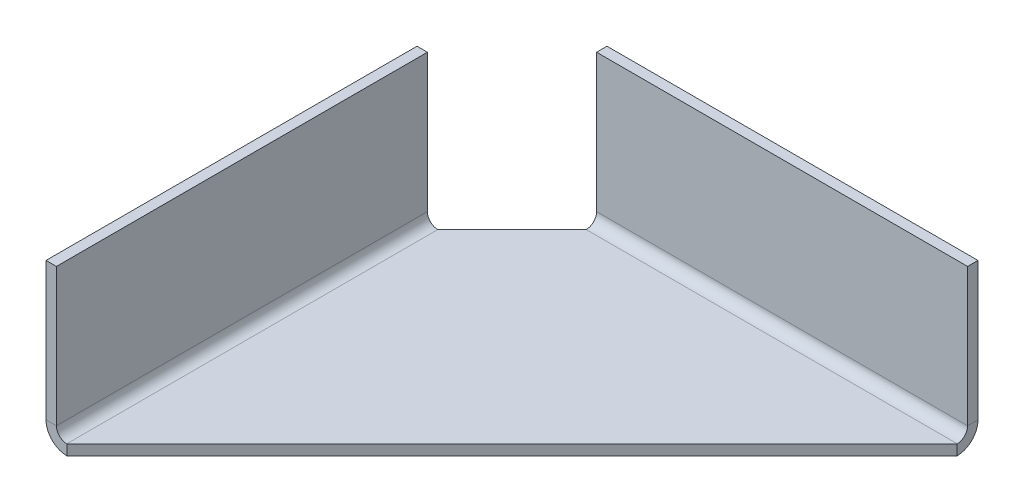
ISO-10303-21;
HEADER;
FILE_DESCRIPTION(('STEP AP214'),'2;1');
FILE_NAME('part.step','',(''),(''),'','','');
FILE_SCHEMA(('AUTOMOTIVE_DESIGN { 1 0 10303 214 1 1 1 1 }'));
ENDSEC;
DATA;
#1=APPLICATION_CONTEXT('core data for automotive mechanical design processes');
#2=APPLICATION_PROTOCOL_DEFINITION('international standard','automotive_design',2000,#1);
#3=PRODUCT_CONTEXT('',#1,'mechanical');
#4=PRODUCT('Part','Part','',(#3));
#5=PRODUCT_RELATED_PRODUCT_CATEGORY('part','',(#4));
#6=PRODUCT_DEFINITION_FORMATION('','',#4);
#7=PRODUCT_DEFINITION_CONTEXT('part definition',#1,'design');
#8=PRODUCT_DEFINITION('design','',#6,#7);
#9=PRODUCT_DEFINITION_SHAPE('','',#8);
#10=(LENGTH_UNIT() NAMED_UNIT(*) SI_UNIT(.MILLI.,.METRE.));
#11=(NAMED_UNIT(*) PLANE_ANGLE_UNIT() SI_UNIT($,.RADIAN.));
#12=(NAMED_UNIT(*) SI_UNIT($,.STERADIAN.) SOLID_ANGLE_UNIT());
#13=UNCERTAINTY_MEASURE_WITH_UNIT(LENGTH_MEASURE(1.E-05),#10,'distance_accuracy_value','');
#14=(GEOMETRIC_REPRESENTATION_CONTEXT(3) GLOBAL_UNCERTAINTY_ASSIGNED_CONTEXT((#13)) GLOBAL_UNIT_ASSIGNED_CONTEXT((#10,
#11,#12)) REPRESENTATION_CONTEXT('',''));
#15=CARTESIAN_POINT('',(0.,0.,0.));
#16=DIRECTION('',(0.,0.,1.));
#17=DIRECTION('',(1.,0.,0.));
#18=AXIS2_PLACEMENT_3D('',#15,#16,#17);
#19=CARTESIAN_POINT('',(30.,-0.7,0.));
#20=DIRECTION('',(0.707106781186548,0.,0.707106781186547));
#21=DIRECTION('',(0.707106781186547,0.,-0.707106781186548));
#22=AXIS2_PLACEMENT_3D('',#19,#20,#21);
#23=PLANE('',#22);
#24=DIRECTION('',(0.707106781186547,0.,-0.707106781186548));
#25=VECTOR('',#24,1.);
#26=CARTESIAN_POINT('',(30.,0.,0.));
#27=LINE('',#26,#25);
#28=CARTESIAN_POINT('',(0.,0.,30.));
#29=VERTEX_POINT('',#28);
#30=CARTESIAN_POINT('',(30.,0.,0.));
#31=VERTEX_POINT('',#30);
#32=EDGE_CURVE('E267',#29,#31,#27,.T.);
#33=ORIENTED_EDGE('',*,*,#32,.F.);
#34=DIRECTION('',(0.,1.,0.));
#35=VECTOR('',#34,1.);
#36=CARTESIAN_POINT('',(0.,-0.7,30.));
#37=LINE('',#36,#35);
#38=CARTESIAN_POINT('',(0.,-0.699999999999998,30.));
#39=VERTEX_POINT('',#38);
#40=EDGE_CURVE('E272',#39,#29,#37,.T.);
#41=ORIENTED_EDGE('',*,*,#40,.F.);
#42=DIRECTION('',(0.707106781186547,0.,-0.707106781186548));
#43=VECTOR('',#42,1.);
#44=CARTESIAN_POINT('',(30.,-0.7,0.));
#45=LINE('',#44,#43);
#46=CARTESIAN_POINT('',(30.,-0.7,0.));
#47=VERTEX_POINT('',#46);
#48=EDGE_CURVE('E269',#39,#47,#45,.T.);
#49=ORIENTED_EDGE('',*,*,#48,.T.);
#50=DIRECTION('',(0.,1.,0.));
#51=VECTOR('',#50,1.);
#52=CARTESIAN_POINT('',(30.,-0.7,0.));
#53=LINE('',#52,#51);
#54=EDGE_CURVE('E278',#47,#31,#53,.T.);
#55=ORIENTED_EDGE('',*,*,#54,.T.);
#56=EDGE_LOOP('',(#33,#41,#49,#55));
#57=FACE_BOUND('',#56,.T.);
#58=ADVANCED_FACE('F78',(#57),#23,.T.);
#59=CARTESIAN_POINT('',(0.,-0.7,0.));
#60=DIRECTION('',(0.,-1.,0.));
#61=DIRECTION('',(0.,0.,-1.));
#62=AXIS2_PLACEMENT_3D('',#59,#60,#61);
#63=PLANE('',#62);
#64=DIRECTION('',(0.,0.,1.));
#65=VECTOR('',#64,1.);
#66=CARTESIAN_POINT('',(0.,-0.7,0.));
#67=LINE('',#66,#65);
#68=CARTESIAN_POINT('',(0.,-0.7,5.));
#69=VERTEX_POINT('',#68);
#70=EDGE_CURVE('E92',#69,#39,#67,.T.);
#71=ORIENTED_EDGE('',*,*,#70,.F.);
#72=DIRECTION('',(-0.707106781186547,0.,0.707106781186548));
#73=VECTOR('',#72,1.);
#74=CARTESIAN_POINT('',(2.5,-0.7,2.5));
#75=LINE('',#74,#73);
#76=CARTESIAN_POINT('',(5.,-0.700000000000008,0.));
#77=VERTEX_POINT('',#76);
#78=EDGE_CURVE('E13',#69,#77,#75,.F.);
#79=ORIENTED_EDGE('',*,*,#78,.T.);
#80=DIRECTION('',(-1.,0.,0.));
#81=VECTOR('',#80,1.);
#82=CARTESIAN_POINT('',(0.,-0.7,0.));
#83=LINE('',#82,#81);
#84=EDGE_CURVE('E174',#47,#77,#83,.T.);
#85=ORIENTED_EDGE('',*,*,#84,.F.);
#86=ORIENTED_EDGE('',*,*,#48,.F.);
#87=EDGE_LOOP('',(#71,#79,#85,#86));
#88=FACE_BOUND('',#87,.T.);
#89=ADVANCED_FACE('F328',(#88),#63,.T.);
#90=CARTESIAN_POINT('',(0.,0.,0.));
#91=DIRECTION('',(0.,-1.,0.));
#92=DIRECTION('',(0.,0.,-1.));
#93=AXIS2_PLACEMENT_3D('',#90,#91,#92);
#94=PLANE('',#93);
#95=DIRECTION('',(-1.,0.,0.));
#96=VECTOR('',#95,1.);
#97=CARTESIAN_POINT('',(0.,0.,0.));
#98=LINE('',#97,#96);
#99=CARTESIAN_POINT('',(5.,0.,0.));
#100=VERTEX_POINT('',#99);
#101=EDGE_CURVE('E257',#31,#100,#98,.T.);
#102=ORIENTED_EDGE('',*,*,#101,.T.);
#103=DIRECTION('',(0.707106781186547,0.,-0.707106781186548));
#104=VECTOR('',#103,1.);
#105=CARTESIAN_POINT('',(5.,0.,0.));
#106=LINE('',#105,#104);
#107=CARTESIAN_POINT('',(0.,0.,5.));
#108=VERTEX_POINT('',#107);
#109=EDGE_CURVE('E100',#100,#108,#106,.F.);
#110=ORIENTED_EDGE('',*,*,#109,.T.);
#111=DIRECTION('',(0.,0.,1.));
#112=VECTOR('',#111,1.);
#113=CARTESIAN_POINT('',(0.,0.,0.));
#114=LINE('',#113,#112);
#115=EDGE_CURVE('E274',#108,#29,#114,.T.);
#116=ORIENTED_EDGE('',*,*,#115,.T.);
#117=ORIENTED_EDGE('',*,*,#32,.T.);
#118=EDGE_LOOP('',(#102,#110,#116,#117));
#119=FACE_BOUND('',#118,.T.);
#120=ADVANCED_FACE('F333',(#119),#94,.F.);
#121=CARTESIAN_POINT('',(5.,-0.7,0.));
#122=DIRECTION('',(0.707106781186548,0.,0.707106781186547));
#123=DIRECTION('',(0.,1.,0.));
#124=AXIS2_PLACEMENT_3D('',#121,#122,#123);
#125=PLANE('',#124);
#126=ORIENTED_EDGE('',*,*,#78,.F.);
#127=DIRECTION('',(0.,-1.,0.));
#128=VECTOR('',#127,1.);
#129=CARTESIAN_POINT('',(0.,-0.7,5.));
#130=LINE('',#129,#128);
#131=EDGE_CURVE('E86',#108,#69,#130,.T.);
#132=ORIENTED_EDGE('',*,*,#131,.F.);
#133=ORIENTED_EDGE('',*,*,#109,.F.);
#134=DIRECTION('',(0.,1.,0.));
#135=VECTOR('',#134,1.);
#136=CARTESIAN_POINT('',(5.,-0.7,0.));
#137=LINE('',#136,#135);
#138=EDGE_CURVE('E280',#77,#100,#137,.T.);
#139=ORIENTED_EDGE('',*,*,#138,.F.);
#140=EDGE_LOOP('',(#126,#132,#133,#139));
#141=FACE_BOUND('',#140,.T.);
#142=ADVANCED_FACE('F80',(#141),#125,.F.);
#143=CARTESIAN_POINT('',(0.,0.699999999999999,5.));
#144=DIRECTION('',(0.,0.,-1.));
#145=DIRECTION('',(-1.,0.,0.));
#146=AXIS2_PLACEMENT_3D('',#143,#144,#145);
#147=PLANE('',#146);
#148=DIRECTION('',(1.,0.,0.));
#149=VECTOR('',#148,1.);
#150=CARTESIAN_POINT('',(-1.4,0.699999999999995,5.));
#151=LINE('',#150,#149);
#152=CARTESIAN_POINT('',(-0.699999999999999,0.699999999999997,5.));
#153=VERTEX_POINT('',#152);
#154=CARTESIAN_POINT('',(-1.4,0.699999999999994,5.));
#155=VERTEX_POINT('',#154);
#156=EDGE_CURVE('E219',#153,#155,#151,.F.);
#157=ORIENTED_EDGE('',*,*,#156,.F.);
#158=CARTESIAN_POINT('',(0.,0.699999999999999,5.));
#159=DIRECTION('',(0.,0.,1.));
#160=DIRECTION('',(1.,0.,0.));
#161=AXIS2_PLACEMENT_3D('',#158,#159,#160);
#162=CIRCLE('',#161,0.7);
#163=EDGE_CURVE('E261',#108,#153,#162,.F.);
#164=ORIENTED_EDGE('',*,*,#163,.F.);
#165=ORIENTED_EDGE('',*,*,#131,.T.);
#166=CARTESIAN_POINT('',(0.,0.699999999999999,5.));
#167=DIRECTION('',(0.,0.,1.));
#168=DIRECTION('',(1.,0.,0.));
#169=AXIS2_PLACEMENT_3D('',#166,#167,#168);
#170=CIRCLE('',#169,1.4);
#171=EDGE_CURVE('E254',#69,#155,#170,.F.);
#172=ORIENTED_EDGE('',*,*,#171,.T.);
#173=EDGE_LOOP('',(#157,#164,#165,#172));
#174=FACE_BOUND('',#173,.T.);
#175=ADVANCED_FACE('F288',(#174),#147,.T.);
#176=CARTESIAN_POINT('',(0.,0.700000000000001,30.));
#177=DIRECTION('',(0.,0.,-1.));
#178=DIRECTION('',(-1.,0.,0.));
#179=AXIS2_PLACEMENT_3D('',#176,#177,#178);
#180=PLANE('',#179);
#181=CARTESIAN_POINT('',(0.,0.700000000000001,30.));
#182=DIRECTION('',(0.,0.,1.));
#183=DIRECTION('',(1.,0.,0.));
#184=AXIS2_PLACEMENT_3D('',#181,#182,#183);
#185=CIRCLE('',#184,0.7);
#186=CARTESIAN_POINT('',(-0.699999999999995,0.699999999999999,30.));
#187=VERTEX_POINT('',#186);
#188=EDGE_CURVE('E227',#187,#29,#185,.T.);
#189=ORIENTED_EDGE('',*,*,#188,.F.);
#190=DIRECTION('',(1.,0.,0.));
#191=VECTOR('',#190,1.);
#192=CARTESIAN_POINT('',(-0.699999999999996,0.699999999999998,30.));
#193=LINE('',#192,#191);
#194=CARTESIAN_POINT('',(-1.4,0.699999999999996,30.));
#195=VERTEX_POINT('',#194);
#196=EDGE_CURVE('E247',#187,#195,#193,.F.);
#197=ORIENTED_EDGE('',*,*,#196,.T.);
#198=CARTESIAN_POINT('',(0.,0.700000000000001,30.));
#199=DIRECTION('',(0.,0.,1.));
#200=DIRECTION('',(1.,0.,0.));
#201=AXIS2_PLACEMENT_3D('',#198,#199,#200);
#202=CIRCLE('',#201,1.4);
#203=EDGE_CURVE('E258',#195,#39,#202,.T.);
#204=ORIENTED_EDGE('',*,*,#203,.T.);
#205=ORIENTED_EDGE('',*,*,#40,.T.);
#206=EDGE_LOOP('',(#189,#197,#204,#205));
#207=FACE_BOUND('',#206,.T.);
#208=ADVANCED_FACE('F339',(#207),#180,.F.);
#209=CARTESIAN_POINT('',(0.,0.700000000000001,30.));
#210=DIRECTION('',(0.,0.,1.));
#211=DIRECTION('',(-1.,0.,0.));
#212=AXIS2_PLACEMENT_3D('',#209,#210,#211);
#213=CYLINDRICAL_SURFACE('',#212,1.4);
#214=ORIENTED_EDGE('',*,*,#70,.T.);
#215=ORIENTED_EDGE('',*,*,#203,.F.);
#216=DIRECTION('',(0.,0.,1.));
#217=VECTOR('',#216,1.);
#218=CARTESIAN_POINT('',(-1.4,0.699999999999995,5.));
#219=LINE('',#218,#217);
#220=EDGE_CURVE('E245',#195,#155,#219,.F.);
#221=ORIENTED_EDGE('',*,*,#220,.T.);
#222=ORIENTED_EDGE('',*,*,#171,.F.);
#223=EDGE_LOOP('',(#214,#215,#221,#222));
#224=FACE_BOUND('',#223,.T.);
#225=ADVANCED_FACE('F292',(#224),#213,.T.);
#226=CARTESIAN_POINT('',(0.,0.700000000000001,30.));
#227=DIRECTION('',(0.,0.,1.));
#228=DIRECTION('',(-1.,0.,0.));
#229=AXIS2_PLACEMENT_3D('',#226,#227,#228);
#230=CYLINDRICAL_SURFACE('',#229,0.7);
#231=ORIENTED_EDGE('',*,*,#115,.F.);
#232=ORIENTED_EDGE('',*,*,#163,.T.);
#233=DIRECTION('',(0.,0.,1.));
#234=VECTOR('',#233,1.);
#235=CARTESIAN_POINT('',(-0.699999999999999,0.699999999999998,5.));
#236=LINE('',#235,#234);
#237=EDGE_CURVE('E250',#153,#187,#236,.T.);
#238=ORIENTED_EDGE('',*,*,#237,.T.);
#239=ORIENTED_EDGE('',*,*,#188,.T.);
#240=EDGE_LOOP('',(#231,#232,#238,#239));
#241=FACE_BOUND('',#240,.T.);
#242=ADVANCED_FACE('F313',(#241),#230,.F.);
#243=CARTESIAN_POINT('',(-1.40000000000003,10.,30.));
#244=DIRECTION('',(0.,0.,-1.));
#245=DIRECTION('',(-1.,0.,0.));
#246=AXIS2_PLACEMENT_3D('',#243,#244,#245);
#247=PLANE('',#246);
#248=ORIENTED_EDGE('',*,*,#196,.F.);
#249=DIRECTION('',(0.,-1.,0.));
#250=VECTOR('',#249,1.);
#251=CARTESIAN_POINT('',(-0.700000000000029,10.,30.));
#252=LINE('',#251,#250);
#253=CARTESIAN_POINT('',(-0.700000000000029,10.,30.));
#254=VERTEX_POINT('',#253);
#255=EDGE_CURVE('E243',#187,#254,#252,.F.);
#256=ORIENTED_EDGE('',*,*,#255,.T.);
#257=DIRECTION('',(1.,0.,0.));
#258=VECTOR('',#257,1.);
#259=CARTESIAN_POINT('',(-1.40000000000003,10.,30.));
#260=LINE('',#259,#258);
#261=CARTESIAN_POINT('',(-1.40000000000003,10.,30.));
#262=VERTEX_POINT('',#261);
#263=EDGE_CURVE('E224',#262,#254,#260,.T.);
#264=ORIENTED_EDGE('',*,*,#263,.F.);
#265=DIRECTION('',(0.,1.,0.));
#266=VECTOR('',#265,1.);
#267=CARTESIAN_POINT('',(-1.39999999999999,0.,30.));
#268=LINE('',#267,#266);
#269=EDGE_CURVE('E236',#195,#262,#268,.T.);
#270=ORIENTED_EDGE('',*,*,#269,.F.);
#271=EDGE_LOOP('',(#248,#256,#264,#270));
#272=FACE_BOUND('',#271,.T.);
#273=ADVANCED_FACE('F301',(#272),#247,.F.);
#274=CARTESIAN_POINT('',(-1.4,0.,5.));
#275=DIRECTION('',(0.,0.,1.));
#276=DIRECTION('',(1.,0.,0.));
#277=AXIS2_PLACEMENT_3D('',#274,#275,#276);
#278=PLANE('',#277);
#279=ORIENTED_EDGE('',*,*,#156,.T.);
#280=DIRECTION('',(0.,-1.,0.));
#281=VECTOR('',#280,1.);
#282=CARTESIAN_POINT('',(-1.4,0.,5.));
#283=LINE('',#282,#281);
#284=CARTESIAN_POINT('',(-1.40000000000003,10.,5.));
#285=VERTEX_POINT('',#284);
#286=EDGE_CURVE('E231',#285,#155,#283,.T.);
#287=ORIENTED_EDGE('',*,*,#286,.F.);
#288=DIRECTION('',(1.,0.,0.));
#289=VECTOR('',#288,1.);
#290=CARTESIAN_POINT('',(-1.40000000000003,10.,5.));
#291=LINE('',#290,#289);
#292=CARTESIAN_POINT('',(-0.700000000000032,10.,5.));
#293=VERTEX_POINT('',#292);
#294=EDGE_CURVE('E228',#285,#293,#291,.T.);
#295=ORIENTED_EDGE('',*,*,#294,.T.);
#296=DIRECTION('',(0.,1.,0.));
#297=VECTOR('',#296,1.);
#298=CARTESIAN_POINT('',(-0.699999999999997,0.,5.));
#299=LINE('',#298,#297);
#300=EDGE_CURVE('E238',#293,#153,#299,.F.);
#301=ORIENTED_EDGE('',*,*,#300,.T.);
#302=EDGE_LOOP('',(#279,#287,#295,#301));
#303=FACE_BOUND('',#302,.T.);
#304=ADVANCED_FACE('F310',(#303),#278,.F.);
#305=CARTESIAN_POINT('',(-1.4,0.,0.));
#306=DIRECTION('',(1.,0.,0.));
#307=DIRECTION('',(0.,1.,0.));
#308=AXIS2_PLACEMENT_3D('',#305,#306,#307);
#309=PLANE('',#308);
#310=ORIENTED_EDGE('',*,*,#220,.F.);
#311=ORIENTED_EDGE('',*,*,#269,.T.);
#312=DIRECTION('',(0.,0.,-1.));
#313=VECTOR('',#312,1.);
#314=CARTESIAN_POINT('',(-1.40000000000003,10.,0.));
#315=LINE('',#314,#313);
#316=EDGE_CURVE('E234',#262,#285,#315,.T.);
#317=ORIENTED_EDGE('',*,*,#316,.T.);
#318=ORIENTED_EDGE('',*,*,#286,.T.);
#319=EDGE_LOOP('',(#310,#311,#317,#318));
#320=FACE_BOUND('',#319,.T.);
#321=ADVANCED_FACE('F296',(#320),#309,.F.);
#322=CARTESIAN_POINT('',(-0.699999999999998,0.,0.));
#323=DIRECTION('',(1.,0.,0.));
#324=DIRECTION('',(0.,1.,0.));
#325=AXIS2_PLACEMENT_3D('',#322,#323,#324);
#326=PLANE('',#325);
#327=ORIENTED_EDGE('',*,*,#255,.F.);
#328=ORIENTED_EDGE('',*,*,#237,.F.);
#329=ORIENTED_EDGE('',*,*,#300,.F.);
#330=DIRECTION('',(0.,0.,1.));
#331=VECTOR('',#330,1.);
#332=CARTESIAN_POINT('',(-0.700000000000032,10.,5.));
#333=LINE('',#332,#331);
#334=EDGE_CURVE('E241',#254,#293,#333,.F.);
#335=ORIENTED_EDGE('',*,*,#334,.F.);
#336=EDGE_LOOP('',(#327,#328,#329,#335));
#337=FACE_BOUND('',#336,.T.);
#338=ADVANCED_FACE('F316',(#337),#326,.T.);
#339=CARTESIAN_POINT('',(-1.40000000000003,10.,5.));
#340=DIRECTION('',(0.,-1.,0.));
#341=DIRECTION('',(1.,0.,0.));
#342=AXIS2_PLACEMENT_3D('',#339,#340,#341);
#343=PLANE('',#342);
#344=ORIENTED_EDGE('',*,*,#334,.T.);
#345=ORIENTED_EDGE('',*,*,#294,.F.);
#346=ORIENTED_EDGE('',*,*,#316,.F.);
#347=ORIENTED_EDGE('',*,*,#263,.T.);
#348=EDGE_LOOP('',(#344,#345,#346,#347));
#349=FACE_BOUND('',#348,.T.);
#350=ADVANCED_FACE('F307',(#349),#343,.F.);
#351=CARTESIAN_POINT('',(30.,0.699999999999993,0.));
#352=DIRECTION('',(1.,0.,0.));
#353=DIRECTION('',(0.,0.,-1.));
#354=AXIS2_PLACEMENT_3D('',#351,#352,#353);
#355=PLANE('',#354);
#356=DIRECTION('',(0.,0.,1.));
#357=VECTOR('',#356,1.);
#358=CARTESIAN_POINT('',(30.,0.700000000000003,-1.4000000000001));
#359=LINE('',#358,#357);
#360=CARTESIAN_POINT('',(30.,0.69999999999999,-0.7));
#361=VERTEX_POINT('',#360);
#362=CARTESIAN_POINT('',(30.,0.699999999999988,-1.4));
#363=VERTEX_POINT('',#362);
#364=EDGE_CURVE('E216',#361,#363,#359,.F.);
#365=ORIENTED_EDGE('',*,*,#364,.F.);
#366=CARTESIAN_POINT('',(30.,0.699999999999993,0.));
#367=DIRECTION('',(-1.,0.,0.));
#368=DIRECTION('',(0.,0.,1.));
#369=AXIS2_PLACEMENT_3D('',#366,#367,#368);
#370=CIRCLE('',#369,0.700000000000001);
#371=EDGE_CURVE('E178',#31,#361,#370,.F.);
#372=ORIENTED_EDGE('',*,*,#371,.F.);
#373=ORIENTED_EDGE('',*,*,#54,.F.);
#374=CARTESIAN_POINT('',(30.,0.699999999999993,0.));
#375=DIRECTION('',(-1.,0.,0.));
#376=DIRECTION('',(0.,0.,1.));
#377=AXIS2_PLACEMENT_3D('',#374,#375,#376);
#378=CIRCLE('',#377,1.4);
#379=EDGE_CURVE('E177',#47,#363,#378,.F.);
#380=ORIENTED_EDGE('',*,*,#379,.T.);
#381=EDGE_LOOP('',(#365,#372,#373,#380));
#382=FACE_BOUND('',#381,.T.);
#383=ADVANCED_FACE('F323',(#382),#355,.T.);
#384=CARTESIAN_POINT('',(5.,0.699999999999993,0.));
#385=DIRECTION('',(1.,0.,0.));
#386=DIRECTION('',(0.,0.,-1.));
#387=AXIS2_PLACEMENT_3D('',#384,#385,#386);
#388=PLANE('',#387);
#389=CARTESIAN_POINT('',(5.,0.699999999999993,0.));
#390=DIRECTION('',(-1.,0.,0.));
#391=DIRECTION('',(0.,0.,1.));
#392=AXIS2_PLACEMENT_3D('',#389,#390,#391);
#393=CIRCLE('',#392,0.700000000000001);
#394=CARTESIAN_POINT('',(5.,0.69999999999999,-0.700000000000002));
#395=VERTEX_POINT('',#394);
#396=EDGE_CURVE('E185',#395,#100,#393,.T.);
#397=ORIENTED_EDGE('',*,*,#396,.F.);
#398=DIRECTION('',(0.,0.,1.));
#399=VECTOR('',#398,1.);
#400=CARTESIAN_POINT('',(5.,0.699999999999998,-0.7));
#401=LINE('',#400,#399);
#402=CARTESIAN_POINT('',(5.,0.700000000000002,-1.4));
#403=VERTEX_POINT('',#402);
#404=EDGE_CURVE('E182',#395,#403,#401,.F.);
#405=ORIENTED_EDGE('',*,*,#404,.T.);
#406=CARTESIAN_POINT('',(5.,0.699999999999993,0.));
#407=DIRECTION('',(-1.,0.,0.));
#408=DIRECTION('',(0.,0.,1.));
#409=AXIS2_PLACEMENT_3D('',#406,#407,#408);
#410=CIRCLE('',#409,1.4);
#411=EDGE_CURVE('E167',#403,#77,#410,.T.);
#412=ORIENTED_EDGE('',*,*,#411,.T.);
#413=ORIENTED_EDGE('',*,*,#138,.T.);
#414=EDGE_LOOP('',(#397,#405,#412,#413));
#415=FACE_BOUND('',#414,.T.);
#416=ADVANCED_FACE('F183',(#415),#388,.F.);
#417=CARTESIAN_POINT('',(5.,0.699999999999993,0.));
#418=DIRECTION('',(-1.,0.,0.));
#419=DIRECTION('',(0.,0.,-1.));
#420=AXIS2_PLACEMENT_3D('',#417,#418,#419);
#421=CYLINDRICAL_SURFACE('',#420,1.4);
#422=ORIENTED_EDGE('',*,*,#84,.T.);
#423=ORIENTED_EDGE('',*,*,#411,.F.);
#424=DIRECTION('',(-1.,0.,0.));
#425=VECTOR('',#424,1.);
#426=CARTESIAN_POINT('',(0.,0.700000000000002,-1.4));
#427=LINE('',#426,#425);
#428=EDGE_CURVE('E172',#363,#403,#427,.T.);
#429=ORIENTED_EDGE('',*,*,#428,.F.);
#430=ORIENTED_EDGE('',*,*,#379,.F.);
#431=EDGE_LOOP('',(#422,#423,#429,#430));
#432=FACE_BOUND('',#431,.T.);
#433=ADVANCED_FACE('F169',(#432),#421,.T.);
#434=CARTESIAN_POINT('',(5.,0.699999999999993,0.));
#435=DIRECTION('',(-1.,0.,0.));
#436=DIRECTION('',(0.,0.,-1.));
#437=AXIS2_PLACEMENT_3D('',#434,#435,#436);
#438=CYLINDRICAL_SURFACE('',#437,0.700000000000001);
#439=ORIENTED_EDGE('',*,*,#101,.F.);
#440=ORIENTED_EDGE('',*,*,#371,.T.);
#441=DIRECTION('',(1.,0.,0.));
#442=VECTOR('',#441,1.);
#443=CARTESIAN_POINT('',(30.,0.699999999999998,-0.7));
#444=LINE('',#443,#442);
#445=EDGE_CURVE('E189',#361,#395,#444,.F.);
#446=ORIENTED_EDGE('',*,*,#445,.T.);
#447=ORIENTED_EDGE('',*,*,#396,.T.);
#448=EDGE_LOOP('',(#439,#440,#446,#447));
#449=FACE_BOUND('',#448,.T.);
#450=ADVANCED_FACE('F400',(#449),#438,.F.);
#451=CARTESIAN_POINT('',(5.,0.,-1.4));
#452=DIRECTION('',(1.,0.,0.));
#453=DIRECTION('',(0.,1.,0.));
#454=AXIS2_PLACEMENT_3D('',#451,#452,#453);
#455=PLANE('',#454);
#456=ORIENTED_EDGE('',*,*,#404,.F.);
#457=DIRECTION('',(0.,1.,0.));
#458=VECTOR('',#457,1.);
#459=CARTESIAN_POINT('',(5.,0.,-0.699999999999998));
#460=LINE('',#459,#458);
#461=CARTESIAN_POINT('',(5.,10.,-0.700000000000032));
#462=VERTEX_POINT('',#461);
#463=EDGE_CURVE('E198',#395,#462,#460,.T.);
#464=ORIENTED_EDGE('',*,*,#463,.T.);
#465=DIRECTION('',(0.,0.,1.));
#466=VECTOR('',#465,1.);
#467=CARTESIAN_POINT('',(5.,10.,-1.40000000000003));
#468=LINE('',#467,#466);
#469=CARTESIAN_POINT('',(5.,10.,-1.40000000000003));
#470=VERTEX_POINT('',#469);
#471=EDGE_CURVE('E202',#470,#462,#468,.T.);
#472=ORIENTED_EDGE('',*,*,#471,.F.);
#473=DIRECTION('',(0.,-1.,0.));
#474=VECTOR('',#473,1.);
#475=CARTESIAN_POINT('',(5.,0.,-1.4));
#476=LINE('',#475,#474);
#477=EDGE_CURVE('E194',#403,#470,#476,.F.);
#478=ORIENTED_EDGE('',*,*,#477,.F.);
#479=EDGE_LOOP('',(#456,#464,#472,#478));
#480=FACE_BOUND('',#479,.T.);
#481=ADVANCED_FACE('F200',(#480),#455,.F.);
#482=CARTESIAN_POINT('',(30.,10.,-1.40000000000003));
#483=DIRECTION('',(-1.,0.,0.));
#484=DIRECTION('',(0.,-1.,0.));
#485=AXIS2_PLACEMENT_3D('',#482,#483,#484);
#486=PLANE('',#485);
#487=ORIENTED_EDGE('',*,*,#364,.T.);
#488=DIRECTION('',(0.,1.,0.));
#489=VECTOR('',#488,1.);
#490=CARTESIAN_POINT('',(30.,0.,-1.4));
#491=LINE('',#490,#489);
#492=CARTESIAN_POINT('',(30.,10.,-1.40000000000003));
#493=VERTEX_POINT('',#492);
#494=EDGE_CURVE('E197',#493,#363,#491,.F.);
#495=ORIENTED_EDGE('',*,*,#494,.F.);
#496=DIRECTION('',(0.,0.,1.));
#497=VECTOR('',#496,1.);
#498=CARTESIAN_POINT('',(30.,10.,-1.40000000000003));
#499=LINE('',#498,#497);
#500=CARTESIAN_POINT('',(30.,10.,-0.700000000000032));
#501=VERTEX_POINT('',#500);
#502=EDGE_CURVE('E560',#493,#501,#499,.T.);
#503=ORIENTED_EDGE('',*,*,#502,.T.);
#504=DIRECTION('',(0.,-1.,0.));
#505=VECTOR('',#504,1.);
#506=CARTESIAN_POINT('',(30.,10.,-0.700000000000032));
#507=LINE('',#506,#505);
#508=EDGE_CURVE('E205',#501,#361,#507,.T.);
#509=ORIENTED_EDGE('',*,*,#508,.T.);
#510=EDGE_LOOP('',(#487,#495,#503,#509));
#511=FACE_BOUND('',#510,.T.);
#512=ADVANCED_FACE('F420',(#511),#486,.F.);
#513=CARTESIAN_POINT('',(0.,0.,-1.4));
#514=DIRECTION('',(0.,0.,-1.));
#515=DIRECTION('',(0.,1.,0.));
#516=AXIS2_PLACEMENT_3D('',#513,#514,#515);
#517=PLANE('',#516);
#518=ORIENTED_EDGE('',*,*,#494,.T.);
#519=ORIENTED_EDGE('',*,*,#428,.T.);
#520=ORIENTED_EDGE('',*,*,#477,.T.);
#521=DIRECTION('',(-1.,0.,0.));
#522=VECTOR('',#521,1.);
#523=CARTESIAN_POINT('',(0.,10.,-1.40000000000003));
#524=LINE('',#523,#522);
#525=EDGE_CURVE('E204',#470,#493,#524,.F.);
#526=ORIENTED_EDGE('',*,*,#525,.T.);
#527=EDGE_LOOP('',(#518,#519,#520,#526));
#528=FACE_BOUND('',#527,.T.);
#529=ADVANCED_FACE('F193',(#528),#517,.T.);
#530=CARTESIAN_POINT('',(0.,0.,-0.699999999999998));
#531=DIRECTION('',(0.,0.,-1.));
#532=DIRECTION('',(0.,1.,0.));
#533=AXIS2_PLACEMENT_3D('',#530,#531,#532);
#534=PLANE('',#533);
#535=ORIENTED_EDGE('',*,*,#445,.F.);
#536=ORIENTED_EDGE('',*,*,#508,.F.);
#537=DIRECTION('',(1.,0.,0.));
#538=VECTOR('',#537,1.);
#539=CARTESIAN_POINT('',(5.,10.,-0.700000000000032));
#540=LINE('',#539,#538);
#541=EDGE_CURVE('E209',#462,#501,#540,.T.);
#542=ORIENTED_EDGE('',*,*,#541,.F.);
#543=ORIENTED_EDGE('',*,*,#463,.F.);
#544=EDGE_LOOP('',(#535,#536,#542,#543));
#545=FACE_BOUND('',#544,.T.);
#546=ADVANCED_FACE('F440',(#545),#534,.F.);
#547=CARTESIAN_POINT('',(5.,10.,-1.40000000000003));
#548=DIRECTION('',(0.,-1.,0.));
#549=DIRECTION('',(0.,0.,-1.));
#550=AXIS2_PLACEMENT_3D('',#547,#548,#549);
#551=PLANE('',#550);
#552=ORIENTED_EDGE('',*,*,#541,.T.);
#553=ORIENTED_EDGE('',*,*,#502,.F.);
#554=ORIENTED_EDGE('',*,*,#525,.F.);
#555=ORIENTED_EDGE('',*,*,#471,.T.);
#556=EDGE_LOOP('',(#552,#553,#554,#555));
#557=FACE_BOUND('',#556,.T.);
#558=ADVANCED_FACE('F450',(#557),#551,.F.);
#559=CLOSED_SHELL('',(#58,#89,#120,#142,#175,#208,#225,#242,#273,#304,#321,#338,#350,#383,#416,
#433,#450,#481,#512,#529,#546,#558));
#560=MANIFOLD_SOLID_BREP('B2',#559);
#561=ADVANCED_BREP_SHAPE_REPRESENTATION('',(#18,#560),#14);
#562=SHAPE_DEFINITION_REPRESENTATION(#9,#561);
ENDSEC;
END-ISO-10303-21;
